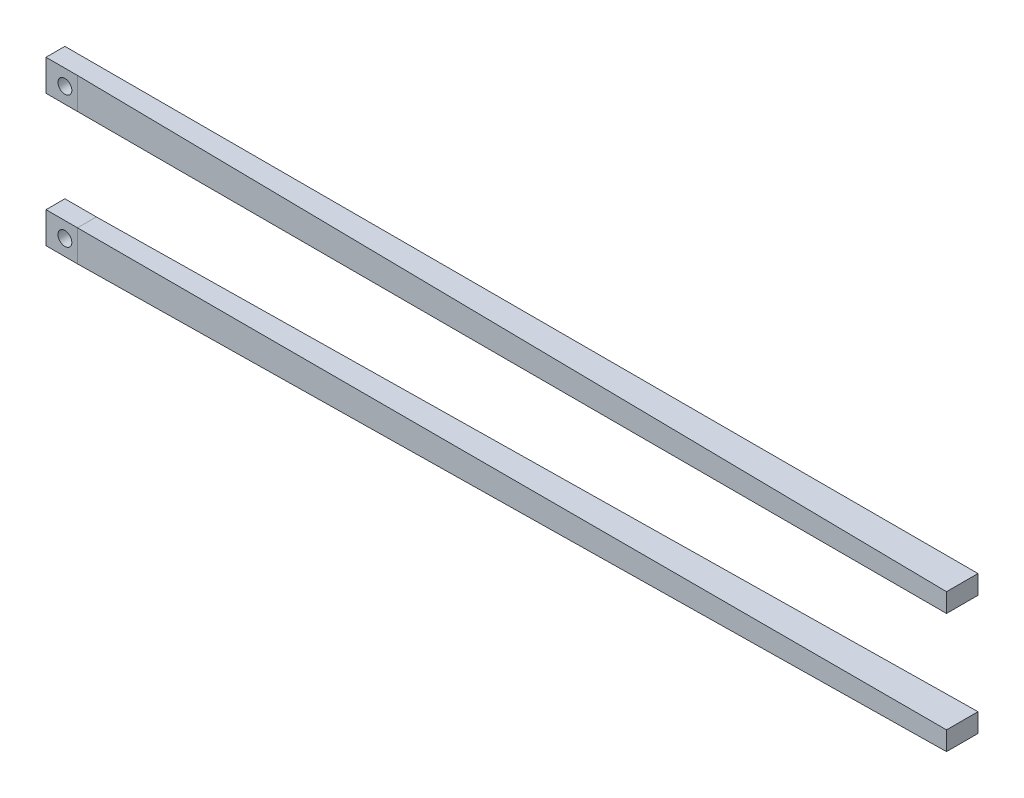
ISO-10303-21;
HEADER;
FILE_DESCRIPTION(('STEP AP214'),'2;1');
FILE_NAME('part.step','',(''),(''),'','','');
FILE_SCHEMA(('AUTOMOTIVE_DESIGN { 1 0 10303 214 1 1 1 1 }'));
ENDSEC;
DATA;
#1=APPLICATION_CONTEXT('core data for automotive mechanical design processes');
#2=APPLICATION_PROTOCOL_DEFINITION('international standard','automotive_design',2000,#1);
#3=PRODUCT_CONTEXT('',#1,'mechanical');
#4=PRODUCT('Part','Part','',(#3));
#5=PRODUCT_RELATED_PRODUCT_CATEGORY('part','',(#4));
#6=PRODUCT_DEFINITION_FORMATION('','',#4);
#7=PRODUCT_DEFINITION_CONTEXT('part definition',#1,'design');
#8=PRODUCT_DEFINITION('design','',#6,#7);
#9=PRODUCT_DEFINITION_SHAPE('','',#8);
#10=(LENGTH_UNIT() NAMED_UNIT(*) SI_UNIT(.MILLI.,.METRE.));
#11=(NAMED_UNIT(*) PLANE_ANGLE_UNIT() SI_UNIT($,.RADIAN.));
#12=(NAMED_UNIT(*) SI_UNIT($,.STERADIAN.) SOLID_ANGLE_UNIT());
#13=UNCERTAINTY_MEASURE_WITH_UNIT(LENGTH_MEASURE(1.E-05),#10,'distance_accuracy_value','');
#14=(GEOMETRIC_REPRESENTATION_CONTEXT(3) GLOBAL_UNCERTAINTY_ASSIGNED_CONTEXT((#13)) GLOBAL_UNIT_ASSIGNED_CONTEXT((#10,
#11,#12)) REPRESENTATION_CONTEXT('',''));
#15=CARTESIAN_POINT('',(0.,0.,0.));
#16=DIRECTION('',(0.,0.,1.));
#17=DIRECTION('',(1.,0.,0.));
#18=AXIS2_PLACEMENT_3D('',#15,#16,#17);
#19=CARTESIAN_POINT('',(0.,-20.96,3.));
#20=DIRECTION('',(1.,0.,0.));
#21=DIRECTION('',(0.,1.,0.));
#22=AXIS2_PLACEMENT_3D('',#19,#20,#21);
#23=PLANE('',#22);
#24=DIRECTION('',(0.,-1.,0.));
#25=VECTOR('',#24,1.);
#26=CARTESIAN_POINT('',(0.,-20.96,0.));
#27=LINE('',#26,#25);
#28=CARTESIAN_POINT('',(0.,-20.96,0.));
#29=VERTEX_POINT('',#28);
#30=CARTESIAN_POINT('',(0.,-25.92,0.));
#31=VERTEX_POINT('',#30);
#32=EDGE_CURVE('E116',#29,#31,#27,.T.);
#33=ORIENTED_EDGE('',*,*,#32,.T.);
#34=DIRECTION('',(0.,0.,-1.));
#35=VECTOR('',#34,1.);
#36=CARTESIAN_POINT('',(0.,-25.92,3.));
#37=LINE('',#36,#35);
#38=CARTESIAN_POINT('',(0.,-25.92,3.));
#39=VERTEX_POINT('',#38);
#40=EDGE_CURVE('E13',#39,#31,#37,.T.);
#41=ORIENTED_EDGE('',*,*,#40,.F.);
#42=DIRECTION('',(0.,-1.,0.));
#43=VECTOR('',#42,1.);
#44=CARTESIAN_POINT('',(0.,-20.96,3.));
#45=LINE('',#44,#43);
#46=CARTESIAN_POINT('',(0.,-20.96,3.));
#47=VERTEX_POINT('',#46);
#48=EDGE_CURVE('E107',#47,#39,#45,.T.);
#49=ORIENTED_EDGE('',*,*,#48,.F.);
#50=DIRECTION('',(0.,0.,-1.));
#51=VECTOR('',#50,1.);
#52=CARTESIAN_POINT('',(0.,-20.96,3.));
#53=LINE('',#52,#51);
#54=EDGE_CURVE('E117',#47,#29,#53,.T.);
#55=ORIENTED_EDGE('',*,*,#54,.T.);
#56=EDGE_LOOP('',(#33,#41,#49,#55));
#57=FACE_BOUND('',#56,.T.);
#58=ADVANCED_FACE('F61',(#57),#23,.F.);
#59=CARTESIAN_POINT('',(0.,-25.92,3.));
#60=DIRECTION('',(0.,1.,0.));
#61=DIRECTION('',(0.,0.,1.));
#62=AXIS2_PLACEMENT_3D('',#59,#60,#61);
#63=PLANE('',#62);
#64=DIRECTION('',(1.,0.,0.));
#65=VECTOR('',#64,1.);
#66=CARTESIAN_POINT('',(0.,-25.92,0.));
#67=LINE('',#66,#65);
#68=CARTESIAN_POINT('',(4.99999999999975,-25.92,0.));
#69=VERTEX_POINT('',#68);
#70=EDGE_CURVE('E120',#31,#69,#67,.T.);
#71=ORIENTED_EDGE('',*,*,#70,.T.);
#72=DIRECTION('',(0.,0.,1.));
#73=VECTOR('',#72,1.);
#74=CARTESIAN_POINT('',(5.,-25.92,0.));
#75=LINE('',#74,#73);
#76=CARTESIAN_POINT('',(5.00000000000006,-25.92,3.));
#77=VERTEX_POINT('',#76);
#78=EDGE_CURVE('E70',#77,#69,#75,.F.);
#79=ORIENTED_EDGE('',*,*,#78,.F.);
#80=DIRECTION('',(1.,0.,0.));
#81=VECTOR('',#80,1.);
#82=CARTESIAN_POINT('',(0.,-25.92,3.));
#83=LINE('',#82,#81);
#84=EDGE_CURVE('E98',#39,#77,#83,.T.);
#85=ORIENTED_EDGE('',*,*,#84,.F.);
#86=ORIENTED_EDGE('',*,*,#40,.T.);
#87=EDGE_LOOP('',(#71,#79,#85,#86));
#88=FACE_BOUND('',#87,.T.);
#89=ADVANCED_FACE('F101',(#88),#63,.F.);
#90=CARTESIAN_POINT('',(0.,-20.96,3.));
#91=DIRECTION('',(0.,-1.,0.));
#92=DIRECTION('',(0.,0.,-1.));
#93=AXIS2_PLACEMENT_3D('',#90,#91,#92);
#94=PLANE('',#93);
#95=DIRECTION('',(-1.,0.,0.));
#96=VECTOR('',#95,1.);
#97=CARTESIAN_POINT('',(0.,-20.96,0.));
#98=LINE('',#97,#96);
#99=CARTESIAN_POINT('',(4.99999999999907,-20.96,0.));
#100=VERTEX_POINT('',#99);
#101=EDGE_CURVE('E113',#100,#29,#98,.T.);
#102=ORIENTED_EDGE('',*,*,#101,.T.);
#103=ORIENTED_EDGE('',*,*,#54,.F.);
#104=DIRECTION('',(-1.,0.,0.));
#105=VECTOR('',#104,1.);
#106=CARTESIAN_POINT('',(0.,-20.96,3.));
#107=LINE('',#106,#105);
#108=CARTESIAN_POINT('',(5.00000000000156,-20.96,3.00000000000001));
#109=VERTEX_POINT('',#108);
#110=EDGE_CURVE('E79',#109,#47,#107,.T.);
#111=ORIENTED_EDGE('',*,*,#110,.F.);
#112=DIRECTION('',(0.,0.,-1.));
#113=VECTOR('',#112,1.);
#114=CARTESIAN_POINT('',(5.,-20.96,3.));
#115=LINE('',#114,#113);
#116=EDGE_CURVE('E64',#109,#100,#115,.T.);
#117=ORIENTED_EDGE('',*,*,#116,.T.);
#118=EDGE_LOOP('',(#102,#103,#111,#117));
#119=FACE_BOUND('',#118,.T.);
#120=ADVANCED_FACE('F156',(#119),#94,.F.);
#121=CARTESIAN_POINT('',(0.,0.,3.));
#122=DIRECTION('',(0.,0.,1.));
#123=DIRECTION('',(1.,0.,0.));
#124=AXIS2_PLACEMENT_3D('',#121,#122,#123);
#125=PLANE('',#124);
#126=CARTESIAN_POINT('',(3.,-23.42,3.));
#127=DIRECTION('',(0.,0.,1.));
#128=DIRECTION('',(1.,0.,0.));
#129=AXIS2_PLACEMENT_3D('',#126,#127,#128);
#130=CIRCLE('',#129,1.09999999999999);
#131=CARTESIAN_POINT('',(4.09999999999999,-23.42,3.));
#132=VERTEX_POINT('',#131);
#133=EDGE_CURVE('E125',#132,#132,#130,.T.);
#134=ORIENTED_EDGE('',*,*,#133,.F.);
#135=EDGE_LOOP('',(#134));
#136=FACE_BOUND('',#135,.T.);
#137=ORIENTED_EDGE('',*,*,#48,.T.);
#138=ORIENTED_EDGE('',*,*,#84,.T.);
#139=DIRECTION('',(0.,1.,0.));
#140=VECTOR('',#139,1.);
#141=CARTESIAN_POINT('',(5.,0.,3.));
#142=LINE('',#141,#140);
#143=EDGE_CURVE('E106',#77,#109,#142,.T.);
#144=ORIENTED_EDGE('',*,*,#143,.T.);
#145=ORIENTED_EDGE('',*,*,#110,.T.);
#146=EDGE_LOOP('',(#137,#138,#144,#145));
#147=FACE_BOUND('',#146,.T.);
#148=ADVANCED_FACE('F110',(#136,#147),#125,.T.);
#149=CARTESIAN_POINT('',(0.,0.,0.));
#150=DIRECTION('',(0.,0.,1.));
#151=DIRECTION('',(1.,0.,0.));
#152=AXIS2_PLACEMENT_3D('',#149,#150,#151);
#153=PLANE('',#152);
#154=CARTESIAN_POINT('',(3.,-23.42,0.));
#155=DIRECTION('',(0.,0.,1.));
#156=DIRECTION('',(1.,0.,0.));
#157=AXIS2_PLACEMENT_3D('',#154,#155,#156);
#158=CIRCLE('',#157,1.09999999999999);
#159=CARTESIAN_POINT('',(4.09999999999999,-23.42,0.));
#160=VERTEX_POINT('',#159);
#161=EDGE_CURVE('E121',#160,#160,#158,.T.);
#162=ORIENTED_EDGE('',*,*,#161,.T.);
#163=EDGE_LOOP('',(#162));
#164=FACE_BOUND('',#163,.T.);
#165=ORIENTED_EDGE('',*,*,#32,.F.);
#166=ORIENTED_EDGE('',*,*,#101,.F.);
#167=DIRECTION('',(0.999902014403647,0.0139986282016511,0.));
#168=VECTOR('',#167,1.);
#169=CARTESIAN_POINT('',(5.,-20.96,0.));
#170=LINE('',#169,#168);
#171=CARTESIAN_POINT('',(145.,-19.,0.));
#172=VERTEX_POINT('',#171);
#173=EDGE_CURVE('E266',#100,#172,#170,.T.);
#174=ORIENTED_EDGE('',*,*,#173,.T.);
#175=DIRECTION('',(0.,-1.,0.));
#176=VECTOR('',#175,1.);
#177=CARTESIAN_POINT('',(145.,-19.,0.));
#178=LINE('',#177,#176);
#179=CARTESIAN_POINT('',(145.,-22.,0.));
#180=VERTEX_POINT('',#179);
#181=EDGE_CURVE('E137',#172,#180,#178,.T.);
#182=ORIENTED_EDGE('',*,*,#181,.T.);
#183=DIRECTION('',(0.999608230345512,0.0279890304496743,0.));
#184=VECTOR('',#183,1.);
#185=CARTESIAN_POINT('',(5.,-25.92,0.));
#186=LINE('',#185,#184);
#187=EDGE_CURVE('E313',#69,#180,#186,.T.);
#188=ORIENTED_EDGE('',*,*,#187,.F.);
#189=ORIENTED_EDGE('',*,*,#70,.F.);
#190=EDGE_LOOP('',(#165,#166,#174,#182,#188,#189));
#191=FACE_BOUND('',#190,.T.);
#192=ADVANCED_FACE('F143',(#164,#191),#153,.F.);
#193=CARTESIAN_POINT('',(3.,-23.42,3.));
#194=DIRECTION('',(0.,0.,1.));
#195=DIRECTION('',(1.,0.,0.));
#196=AXIS2_PLACEMENT_3D('',#193,#194,#195);
#197=CYLINDRICAL_SURFACE('',#196,1.09999999999999);
#198=ORIENTED_EDGE('',*,*,#161,.F.);
#199=EDGE_LOOP('',(#198));
#200=FACE_BOUND('',#199,.T.);
#201=ORIENTED_EDGE('',*,*,#133,.T.);
#202=EDGE_LOOP('',(#201));
#203=FACE_BOUND('',#202,.T.);
#204=ADVANCED_FACE('F153',(#200,#203),#197,.F.);
#205=CARTESIAN_POINT('',(145.,0.,0.));
#206=DIRECTION('',(1.,0.,0.));
#207=DIRECTION('',(0.,0.,-1.));
#208=AXIS2_PLACEMENT_3D('',#205,#206,#207);
#209=PLANE('',#208);
#210=DIRECTION('',(0.,-1.,0.));
#211=VECTOR('',#210,1.);
#212=CARTESIAN_POINT('',(145.,-19.,5.));
#213=LINE('',#212,#211);
#214=CARTESIAN_POINT('',(145.,-19.,5.));
#215=VERTEX_POINT('',#214);
#216=CARTESIAN_POINT('',(145.,-22.,5.));
#217=VERTEX_POINT('',#216);
#218=EDGE_CURVE('E288',#215,#217,#213,.T.);
#219=ORIENTED_EDGE('',*,*,#218,.T.);
#220=DIRECTION('',(0.,0.,-1.));
#221=VECTOR('',#220,1.);
#222=CARTESIAN_POINT('',(145.,-22.,5.));
#223=LINE('',#222,#221);
#224=EDGE_CURVE('E282',#217,#180,#223,.T.);
#225=ORIENTED_EDGE('',*,*,#224,.T.);
#226=ORIENTED_EDGE('',*,*,#181,.F.);
#227=DIRECTION('',(0.,0.,-1.));
#228=VECTOR('',#227,1.);
#229=CARTESIAN_POINT('',(145.,-19.,5.));
#230=LINE('',#229,#228);
#231=EDGE_CURVE('E262',#215,#172,#230,.T.);
#232=ORIENTED_EDGE('',*,*,#231,.F.);
#233=EDGE_LOOP('',(#219,#225,#226,#232));
#234=FACE_BOUND('',#233,.T.);
#235=ADVANCED_FACE('F174',(#234),#209,.T.);
#236=CARTESIAN_POINT('',(-0.0418281983268721,0.,2.92797388288104));
#237=DIRECTION('',(0.0142842567828501,0.,-0.99989797479951));
#238=DIRECTION('',(-0.99989797479951,0.,-0.0142842567828501));
#239=AXIS2_PLACEMENT_3D('',#236,#237,#238);
#240=PLANE('',#239);
#241=DIRECTION('',(0.999506324996967,0.0279861770999151,0.014278661785671));
#242=VECTOR('',#241,1.);
#243=CARTESIAN_POINT('',(5.,-25.92,3.));
#244=LINE('',#243,#242);
#245=EDGE_CURVE('E307',#77,#217,#244,.T.);
#246=ORIENTED_EDGE('',*,*,#245,.T.);
#247=ORIENTED_EDGE('',*,*,#218,.F.);
#248=DIRECTION('',(0.99980001918816,0.0139972002686343,0.0142828574169737));
#249=VECTOR('',#248,1.);
#250=CARTESIAN_POINT('',(5.,-20.96,3.));
#251=LINE('',#250,#249);
#252=EDGE_CURVE('E303',#109,#215,#251,.T.);
#253=ORIENTED_EDGE('',*,*,#252,.F.);
#254=ORIENTED_EDGE('',*,*,#143,.F.);
#255=EDGE_LOOP('',(#246,#247,#253,#254));
#256=FACE_BOUND('',#255,.T.);
#257=ADVANCED_FACE('F208',(#256),#240,.F.);
#258=CARTESIAN_POINT('',(0.294362304988223,-21.0258789277302,0.));
#259=DIRECTION('',(-0.0139986282016511,0.999902014403647,0.));
#260=DIRECTION('',(-0.999902014403647,-0.0139986282016511,0.));
#261=AXIS2_PLACEMENT_3D('',#258,#259,#260);
#262=PLANE('',#261);
#263=ORIENTED_EDGE('',*,*,#252,.T.);
#264=ORIENTED_EDGE('',*,*,#231,.T.);
#265=ORIENTED_EDGE('',*,*,#173,.F.);
#266=ORIENTED_EDGE('',*,*,#116,.F.);
#267=EDGE_LOOP('',(#263,#264,#265,#266));
#268=FACE_BOUND('',#267,.T.);
#269=ADVANCED_FACE('F218',(#268),#262,.T.);
#270=CARTESIAN_POINT('',(0.72910837903084,-26.0395849653871,0.));
#271=DIRECTION('',(-0.0279890304496743,0.999608230345512,0.));
#272=DIRECTION('',(-0.999608230345512,-0.0279890304496743,0.));
#273=AXIS2_PLACEMENT_3D('',#270,#271,#272);
#274=PLANE('',#273);
#275=ORIENTED_EDGE('',*,*,#187,.T.);
#276=ORIENTED_EDGE('',*,*,#224,.F.);
#277=ORIENTED_EDGE('',*,*,#245,.F.);
#278=ORIENTED_EDGE('',*,*,#78,.T.);
#279=EDGE_LOOP('',(#275,#276,#277,#278));
#280=FACE_BOUND('',#279,.T.);
#281=ADVANCED_FACE('F228',(#280),#274,.F.);
#282=CLOSED_SHELL('',(#58,#89,#120,#148,#192,#204,#235,#257,#269,#281));
#283=MANIFOLD_SOLID_BREP('B2',#282);
#284=CARTESIAN_POINT('',(0.,0.,3.));
#285=DIRECTION('',(1.,0.,0.));
#286=DIRECTION('',(0.,0.,-1.));
#287=AXIS2_PLACEMENT_3D('',#284,#285,#286);
#288=PLANE('',#287);
#289=DIRECTION('',(0.,-1.,0.));
#290=VECTOR('',#289,1.);
#291=CARTESIAN_POINT('',(0.,0.,0.));
#292=LINE('',#291,#290);
#293=CARTESIAN_POINT('',(0.,0.,0.));
#294=VERTEX_POINT('',#293);
#295=CARTESIAN_POINT('',(0.,-4.96,0.));
#296=VERTEX_POINT('',#295);
#297=EDGE_CURVE('E423',#294,#296,#292,.T.);
#298=ORIENTED_EDGE('',*,*,#297,.T.);
#299=DIRECTION('',(0.,0.,-1.));
#300=VECTOR('',#299,1.);
#301=CARTESIAN_POINT('',(0.,-4.96,3.));
#302=LINE('',#301,#300);
#303=CARTESIAN_POINT('',(0.,-4.96,3.));
#304=VERTEX_POINT('',#303);
#305=EDGE_CURVE('E59',#304,#296,#302,.T.);
#306=ORIENTED_EDGE('',*,*,#305,.F.);
#307=DIRECTION('',(0.,-1.,0.));
#308=VECTOR('',#307,1.);
#309=CARTESIAN_POINT('',(0.,0.,3.));
#310=LINE('',#309,#308);
#311=CARTESIAN_POINT('',(0.,0.,3.));
#312=VERTEX_POINT('',#311);
#313=EDGE_CURVE('E414',#312,#304,#310,.T.);
#314=ORIENTED_EDGE('',*,*,#313,.F.);
#315=DIRECTION('',(0.,0.,-1.));
#316=VECTOR('',#315,1.);
#317=CARTESIAN_POINT('',(0.,0.,3.));
#318=LINE('',#317,#316);
#319=EDGE_CURVE('E424',#312,#294,#318,.T.);
#320=ORIENTED_EDGE('',*,*,#319,.T.);
#321=EDGE_LOOP('',(#298,#306,#314,#320));
#322=FACE_BOUND('',#321,.T.);
#323=ADVANCED_FACE('F371',(#322),#288,.F.);
#324=CARTESIAN_POINT('',(0.,-4.96,3.));
#325=DIRECTION('',(0.,1.,0.));
#326=DIRECTION('',(0.,0.,1.));
#327=AXIS2_PLACEMENT_3D('',#324,#325,#326);
#328=PLANE('',#327);
#329=DIRECTION('',(1.,0.,0.));
#330=VECTOR('',#329,1.);
#331=CARTESIAN_POINT('',(0.,-4.96,0.));
#332=LINE('',#331,#330);
#333=CARTESIAN_POINT('',(4.99999999999906,-4.96000000000001,0.));
#334=VERTEX_POINT('',#333);
#335=EDGE_CURVE('E427',#296,#334,#332,.T.);
#336=ORIENTED_EDGE('',*,*,#335,.T.);
#337=DIRECTION('',(0.,0.,1.));
#338=VECTOR('',#337,1.);
#339=CARTESIAN_POINT('',(5.00000000000001,-4.96,0.));
#340=LINE('',#339,#338);
#341=CARTESIAN_POINT('',(5.00000000000156,-4.95999999999999,3.00000000000001));
#342=VERTEX_POINT('',#341);
#343=EDGE_CURVE('E380',#342,#334,#340,.F.);
#344=ORIENTED_EDGE('',*,*,#343,.F.);
#345=DIRECTION('',(1.,0.,0.));
#346=VECTOR('',#345,1.);
#347=CARTESIAN_POINT('',(0.,-4.96,3.));
#348=LINE('',#347,#346);
#349=EDGE_CURVE('E406',#304,#342,#348,.T.);
#350=ORIENTED_EDGE('',*,*,#349,.F.);
#351=ORIENTED_EDGE('',*,*,#305,.T.);
#352=EDGE_LOOP('',(#336,#344,#350,#351));
#353=FACE_BOUND('',#352,.T.);
#354=ADVANCED_FACE('F409',(#353),#328,.F.);
#355=CARTESIAN_POINT('',(0.,0.,3.));
#356=DIRECTION('',(0.,-1.,0.));
#357=DIRECTION('',(0.,0.,-1.));
#358=AXIS2_PLACEMENT_3D('',#355,#356,#357);
#359=PLANE('',#358);
#360=DIRECTION('',(-1.,0.,0.));
#361=VECTOR('',#360,1.);
#362=CARTESIAN_POINT('',(0.,0.,0.));
#363=LINE('',#362,#361);
#364=CARTESIAN_POINT('',(145.,0.,0.));
#365=VERTEX_POINT('',#364);
#366=EDGE_CURVE('E420',#365,#294,#363,.T.);
#367=ORIENTED_EDGE('',*,*,#366,.T.);
#368=ORIENTED_EDGE('',*,*,#319,.F.);
#369=DIRECTION('',(-1.,0.,0.));
#370=VECTOR('',#369,1.);
#371=CARTESIAN_POINT('',(0.,0.,3.));
#372=LINE('',#371,#370);
#373=CARTESIAN_POINT('',(5.00000000000322,0.,3.00000000000002));
#374=VERTEX_POINT('',#373);
#375=EDGE_CURVE('E388',#374,#312,#372,.T.);
#376=ORIENTED_EDGE('',*,*,#375,.F.);
#377=DIRECTION('',(0.99989797479951,0.,0.0142842567828501));
#378=VECTOR('',#377,1.);
#379=CARTESIAN_POINT('',(5.,0.,3.));
#380=LINE('',#379,#378);
#381=CARTESIAN_POINT('',(145.,0.,5.));
#382=VERTEX_POINT('',#381);
#383=EDGE_CURVE('E568',#374,#382,#380,.T.);
#384=ORIENTED_EDGE('',*,*,#383,.T.);
#385=DIRECTION('',(0.,0.,1.));
#386=VECTOR('',#385,1.);
#387=CARTESIAN_POINT('',(145.,0.,5.));
#388=LINE('',#387,#386);
#389=EDGE_CURVE('E446',#365,#382,#388,.T.);
#390=ORIENTED_EDGE('',*,*,#389,.F.);
#391=EDGE_LOOP('',(#367,#368,#376,#384,#390));
#392=FACE_BOUND('',#391,.T.);
#393=ADVANCED_FACE('F453',(#392),#359,.F.);
#394=CARTESIAN_POINT('',(0.,0.,3.));
#395=DIRECTION('',(0.,0.,1.));
#396=DIRECTION('',(1.,0.,0.));
#397=AXIS2_PLACEMENT_3D('',#394,#395,#396);
#398=PLANE('',#397);
#399=CARTESIAN_POINT('',(3.,-2.5,3.));
#400=DIRECTION('',(0.,0.,1.));
#401=DIRECTION('',(1.,0.,0.));
#402=AXIS2_PLACEMENT_3D('',#399,#400,#401);
#403=CIRCLE('',#402,1.09999999999999);
#404=CARTESIAN_POINT('',(4.09999999999999,-2.5,3.));
#405=VERTEX_POINT('',#404);
#406=EDGE_CURVE('E432',#405,#405,#403,.T.);
#407=ORIENTED_EDGE('',*,*,#406,.F.);
#408=EDGE_LOOP('',(#407));
#409=FACE_BOUND('',#408,.T.);
#410=ORIENTED_EDGE('',*,*,#313,.T.);
#411=ORIENTED_EDGE('',*,*,#349,.T.);
#412=DIRECTION('',(0.,1.,0.));
#413=VECTOR('',#412,1.);
#414=CARTESIAN_POINT('',(5.,0.,3.));
#415=LINE('',#414,#413);
#416=EDGE_CURVE('E374',#342,#374,#415,.T.);
#417=ORIENTED_EDGE('',*,*,#416,.T.);
#418=ORIENTED_EDGE('',*,*,#375,.T.);
#419=EDGE_LOOP('',(#410,#411,#417,#418));
#420=FACE_BOUND('',#419,.T.);
#421=ADVANCED_FACE('F417',(#409,#420),#398,.T.);
#422=CARTESIAN_POINT('',(0.,0.,0.));
#423=DIRECTION('',(0.,0.,1.));
#424=DIRECTION('',(1.,0.,0.));
#425=AXIS2_PLACEMENT_3D('',#422,#423,#424);
#426=PLANE('',#425);
#427=CARTESIAN_POINT('',(3.,-2.5,0.));
#428=DIRECTION('',(0.,0.,1.));
#429=DIRECTION('',(1.,0.,0.));
#430=AXIS2_PLACEMENT_3D('',#427,#428,#429);
#431=CIRCLE('',#430,1.09999999999999);
#432=CARTESIAN_POINT('',(4.09999999999999,-2.5,0.));
#433=VERTEX_POINT('',#432);
#434=EDGE_CURVE('E428',#433,#433,#431,.T.);
#435=ORIENTED_EDGE('',*,*,#434,.T.);
#436=EDGE_LOOP('',(#435));
#437=FACE_BOUND('',#436,.T.);
#438=ORIENTED_EDGE('',*,*,#297,.F.);
#439=ORIENTED_EDGE('',*,*,#366,.F.);
#440=DIRECTION('',(0.,1.,0.));
#441=VECTOR('',#440,1.);
#442=CARTESIAN_POINT('',(145.,-3.,0.));
#443=LINE('',#442,#441);
#444=CARTESIAN_POINT('',(145.,-3.,0.));
#445=VERTEX_POINT('',#444);
#446=EDGE_CURVE('E569',#445,#365,#443,.T.);
#447=ORIENTED_EDGE('',*,*,#446,.F.);
#448=DIRECTION('',(0.999902014403647,0.0139986282016511,0.));
#449=VECTOR('',#448,1.);
#450=CARTESIAN_POINT('',(5.,-4.96,0.));
#451=LINE('',#450,#449);
#452=EDGE_CURVE('E605',#334,#445,#451,.T.);
#453=ORIENTED_EDGE('',*,*,#452,.F.);
#454=ORIENTED_EDGE('',*,*,#335,.F.);
#455=EDGE_LOOP('',(#438,#439,#447,#453,#454));
#456=FACE_BOUND('',#455,.T.);
#457=ADVANCED_FACE('F462',(#437,#456),#426,.F.);
#458=CARTESIAN_POINT('',(3.,-2.5,3.));
#459=DIRECTION('',(0.,0.,1.));
#460=DIRECTION('',(1.,0.,0.));
#461=AXIS2_PLACEMENT_3D('',#458,#459,#460);
#462=CYLINDRICAL_SURFACE('',#461,1.09999999999999);
#463=ORIENTED_EDGE('',*,*,#434,.F.);
#464=EDGE_LOOP('',(#463));
#465=FACE_BOUND('',#464,.T.);
#466=ORIENTED_EDGE('',*,*,#406,.T.);
#467=EDGE_LOOP('',(#466));
#468=FACE_BOUND('',#467,.T.);
#469=ADVANCED_FACE('F477',(#465,#468),#462,.F.);
#470=CARTESIAN_POINT('',(145.,0.,0.));
#471=DIRECTION('',(-1.,0.,0.));
#472=DIRECTION('',(0.,0.,1.));
#473=AXIS2_PLACEMENT_3D('',#470,#471,#472);
#474=PLANE('',#473);
#475=DIRECTION('',(0.,-1.,0.));
#476=VECTOR('',#475,1.);
#477=CARTESIAN_POINT('',(145.,-3.,5.));
#478=LINE('',#477,#476);
#479=CARTESIAN_POINT('',(145.,-3.,5.));
#480=VERTEX_POINT('',#479);
#481=EDGE_CURVE('E561',#382,#480,#478,.T.);
#482=ORIENTED_EDGE('',*,*,#481,.T.);
#483=DIRECTION('',(0.,0.,-1.));
#484=VECTOR('',#483,1.);
#485=CARTESIAN_POINT('',(145.,-3.,5.));
#486=LINE('',#485,#484);
#487=EDGE_CURVE('E564',#480,#445,#486,.T.);
#488=ORIENTED_EDGE('',*,*,#487,.T.);
#489=ORIENTED_EDGE('',*,*,#446,.T.);
#490=ORIENTED_EDGE('',*,*,#389,.T.);
#491=EDGE_LOOP('',(#482,#488,#489,#490));
#492=FACE_BOUND('',#491,.T.);
#493=ADVANCED_FACE('F481',(#492),#474,.F.);
#494=CARTESIAN_POINT('',(0.0704062003847248,-5.02901431319461,0.));
#495=DIRECTION('',(-0.0139986282016511,0.999902014403647,0.));
#496=DIRECTION('',(-0.999902014403647,-0.0139986282016511,0.));
#497=AXIS2_PLACEMENT_3D('',#494,#495,#496);
#498=PLANE('',#497);
#499=ORIENTED_EDGE('',*,*,#452,.T.);
#500=ORIENTED_EDGE('',*,*,#487,.F.);
#501=DIRECTION('',(0.99980001918816,0.0139972002686343,0.0142828574169737));
#502=VECTOR('',#501,1.);
#503=CARTESIAN_POINT('',(5.,-4.96,3.));
#504=LINE('',#503,#502);
#505=EDGE_CURVE('E602',#342,#480,#504,.T.);
#506=ORIENTED_EDGE('',*,*,#505,.F.);
#507=ORIENTED_EDGE('',*,*,#343,.T.);
#508=EDGE_LOOP('',(#499,#500,#506,#507));
#509=FACE_BOUND('',#508,.T.);
#510=ADVANCED_FACE('F519',(#509),#498,.F.);
#511=CARTESIAN_POINT('',(-0.0418281983268721,0.,2.92797388288104));
#512=DIRECTION('',(0.0142842567828501,0.,-0.99989797479951));
#513=DIRECTION('',(-0.99989797479951,0.,-0.0142842567828502));
#514=AXIS2_PLACEMENT_3D('',#511,#512,#513);
#515=PLANE('',#514);
#516=ORIENTED_EDGE('',*,*,#505,.T.);
#517=ORIENTED_EDGE('',*,*,#481,.F.);
#518=ORIENTED_EDGE('',*,*,#383,.F.);
#519=ORIENTED_EDGE('',*,*,#416,.F.);
#520=EDGE_LOOP('',(#516,#517,#518,#519));
#521=FACE_BOUND('',#520,.T.);
#522=ADVANCED_FACE('F529',(#521),#515,.F.);
#523=CLOSED_SHELL('',(#323,#354,#393,#421,#457,#469,#493,#510,#522));
#524=MANIFOLD_SOLID_BREP('B7',#523);
#525=ADVANCED_BREP_SHAPE_REPRESENTATION('',(#18,#283,#524),#14);
#526=SHAPE_DEFINITION_REPRESENTATION(#9,#525);
ENDSEC;
END-ISO-10303-21;
